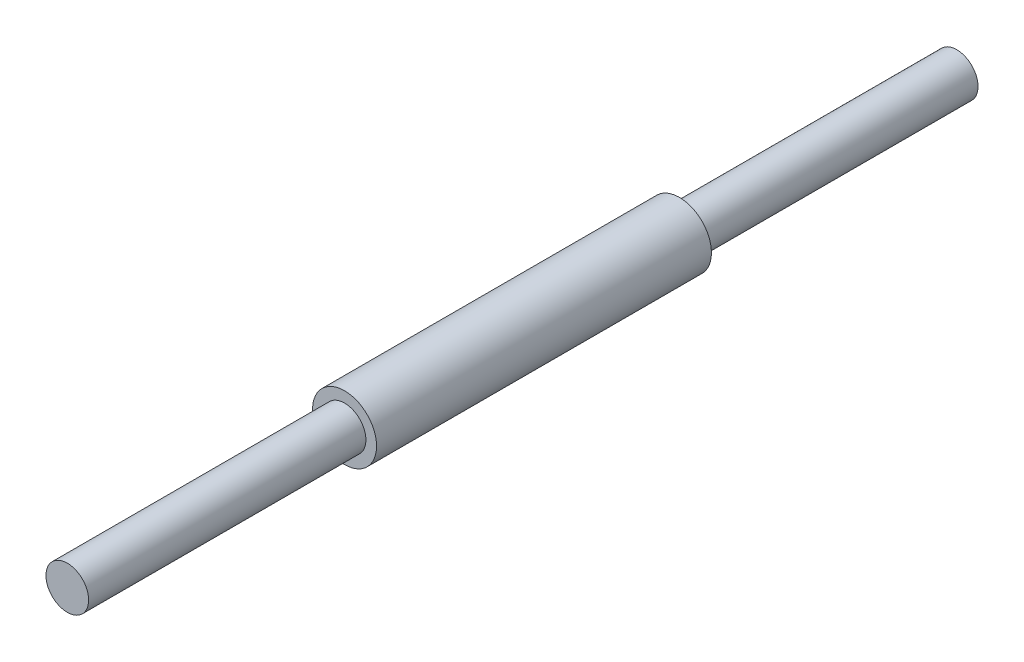
ISO-10303-21;
HEADER;
FILE_DESCRIPTION(('STEP AP214'),'2;1');
FILE_NAME('part.step','',(''),(''),'','','');
FILE_SCHEMA(('AUTOMOTIVE_DESIGN { 1 0 10303 214 1 1 1 1 }'));
ENDSEC;
DATA;
#1=APPLICATION_CONTEXT('core data for automotive mechanical design processes');
#2=APPLICATION_PROTOCOL_DEFINITION('international standard','automotive_design',2000,#1);
#3=PRODUCT_CONTEXT('',#1,'mechanical');
#4=PRODUCT('Part','Part','',(#3));
#5=PRODUCT_RELATED_PRODUCT_CATEGORY('part','',(#4));
#6=PRODUCT_DEFINITION_FORMATION('','',#4);
#7=PRODUCT_DEFINITION_CONTEXT('part definition',#1,'design');
#8=PRODUCT_DEFINITION('design','',#6,#7);
#9=PRODUCT_DEFINITION_SHAPE('','',#8);
#10=(LENGTH_UNIT() NAMED_UNIT(*) SI_UNIT(.MILLI.,.METRE.));
#11=(NAMED_UNIT(*) PLANE_ANGLE_UNIT() SI_UNIT($,.RADIAN.));
#12=(NAMED_UNIT(*) SI_UNIT($,.STERADIAN.) SOLID_ANGLE_UNIT());
#13=UNCERTAINTY_MEASURE_WITH_UNIT(LENGTH_MEASURE(1.E-05),#10,'distance_accuracy_value','');
#14=(GEOMETRIC_REPRESENTATION_CONTEXT(3) GLOBAL_UNCERTAINTY_ASSIGNED_CONTEXT((#13)) GLOBAL_UNIT_ASSIGNED_CONTEXT((#10,
#11,#12)) REPRESENTATION_CONTEXT('',''));
#15=CARTESIAN_POINT('',(0.,0.,0.));
#16=DIRECTION('',(0.,0.,1.));
#17=DIRECTION('',(1.,0.,0.));
#18=AXIS2_PLACEMENT_3D('',#15,#16,#17);
#19=CARTESIAN_POINT('',(0.,0.,39.878));
#20=DIRECTION('',(0.,0.,-1.));
#21=DIRECTION('',(-1.,0.,0.));
#22=AXIS2_PLACEMENT_3D('',#19,#20,#21);
#23=CYLINDRICAL_SURFACE('',#22,3.81);
#24=CARTESIAN_POINT('',(0.,0.,39.878));
#25=DIRECTION('',(0.,0.,1.));
#26=DIRECTION('',(1.,0.,0.));
#27=AXIS2_PLACEMENT_3D('',#24,#25,#26);
#28=CIRCLE('',#27,3.81);
#29=CARTESIAN_POINT('',(3.81,0.,39.878));
#30=VERTEX_POINT('',#29);
#31=EDGE_CURVE('E51',#30,#30,#28,.T.);
#32=ORIENTED_EDGE('',*,*,#31,.F.);
#33=EDGE_LOOP('',(#32));
#34=FACE_BOUND('',#33,.T.);
#35=CARTESIAN_POINT('',(0.,0.,0.));
#36=DIRECTION('',(0.,0.,1.));
#37=DIRECTION('',(1.,0.,0.));
#38=AXIS2_PLACEMENT_3D('',#35,#36,#37);
#39=CIRCLE('',#38,3.81);
#40=CARTESIAN_POINT('',(3.81,0.,0.));
#41=VERTEX_POINT('',#40);
#42=EDGE_CURVE('E40',#41,#41,#39,.T.);
#43=ORIENTED_EDGE('',*,*,#42,.T.);
#44=EDGE_LOOP('',(#43));
#45=FACE_BOUND('',#44,.T.);
#46=ADVANCED_FACE('F37',(#34,#45),#23,.T.);
#47=CARTESIAN_POINT('',(0.,0.,39.878));
#48=DIRECTION('',(0.,0.,1.));
#49=DIRECTION('',(1.,0.,0.));
#50=AXIS2_PLACEMENT_3D('',#47,#48,#49);
#51=PLANE('',#50);
#52=CARTESIAN_POINT('',(0.,0.,39.878));
#53=DIRECTION('',(0.,0.,1.));
#54=DIRECTION('',(1.,0.,0.));
#55=AXIS2_PLACEMENT_3D('',#52,#53,#54);
#56=CIRCLE('',#55,2.54);
#57=CARTESIAN_POINT('',(2.54,0.,39.878));
#58=VERTEX_POINT('',#57);
#59=EDGE_CURVE('E45',#58,#58,#56,.T.);
#60=ORIENTED_EDGE('',*,*,#59,.F.);
#61=EDGE_LOOP('',(#60));
#62=FACE_BOUND('',#61,.T.);
#63=ORIENTED_EDGE('',*,*,#31,.T.);
#64=EDGE_LOOP('',(#63));
#65=FACE_BOUND('',#64,.T.);
#66=ADVANCED_FACE('F71',(#62,#65),#51,.T.);
#67=CARTESIAN_POINT('',(0.,0.,0.));
#68=DIRECTION('',(0.,0.,1.));
#69=DIRECTION('',(1.,0.,0.));
#70=AXIS2_PLACEMENT_3D('',#67,#68,#69);
#71=PLANE('',#70);
#72=CARTESIAN_POINT('',(0.,0.,0.));
#73=DIRECTION('',(0.,0.,-1.));
#74=DIRECTION('',(-1.,0.,0.));
#75=AXIS2_PLACEMENT_3D('',#72,#73,#74);
#76=CIRCLE('',#75,2.54);
#77=CARTESIAN_POINT('',(-2.54,0.,0.));
#78=VERTEX_POINT('',#77);
#79=EDGE_CURVE('E10',#78,#78,#76,.T.);
#80=ORIENTED_EDGE('',*,*,#79,.F.);
#81=EDGE_LOOP('',(#80));
#82=FACE_BOUND('',#81,.T.);
#83=ORIENTED_EDGE('',*,*,#42,.F.);
#84=EDGE_LOOP('',(#83));
#85=FACE_BOUND('',#84,.T.);
#86=ADVANCED_FACE('F68',(#82,#85),#71,.F.);
#87=CARTESIAN_POINT('',(0.,0.,72.898));
#88=DIRECTION('',(0.,0.,-1.));
#89=DIRECTION('',(-1.,0.,0.));
#90=AXIS2_PLACEMENT_3D('',#87,#88,#89);
#91=CYLINDRICAL_SURFACE('',#90,2.54);
#92=CARTESIAN_POINT('',(0.,0.,72.898));
#93=DIRECTION('',(0.,0.,1.));
#94=DIRECTION('',(1.,0.,0.));
#95=AXIS2_PLACEMENT_3D('',#92,#93,#94);
#96=CIRCLE('',#95,2.54);
#97=CARTESIAN_POINT('',(2.54,0.,72.898));
#98=VERTEX_POINT('',#97);
#99=EDGE_CURVE('E56',#98,#98,#96,.T.);
#100=ORIENTED_EDGE('',*,*,#99,.F.);
#101=EDGE_LOOP('',(#100));
#102=FACE_BOUND('',#101,.T.);
#103=ORIENTED_EDGE('',*,*,#59,.T.);
#104=EDGE_LOOP('',(#103));
#105=FACE_BOUND('',#104,.T.);
#106=ADVANCED_FACE('F70',(#102,#105),#91,.T.);
#107=CARTESIAN_POINT('',(0.,0.,72.898));
#108=DIRECTION('',(0.,0.,1.));
#109=DIRECTION('',(1.,0.,0.));
#110=AXIS2_PLACEMENT_3D('',#107,#108,#109);
#111=PLANE('',#110);
#112=ORIENTED_EDGE('',*,*,#99,.T.);
#113=EDGE_LOOP('',(#112));
#114=FACE_BOUND('',#113,.T.);
#115=ADVANCED_FACE('F77',(#114),#111,.T.);
#116=CARTESIAN_POINT('',(0.,0.,-33.02));
#117=DIRECTION('',(0.,0.,1.));
#118=DIRECTION('',(1.,0.,0.));
#119=AXIS2_PLACEMENT_3D('',#116,#117,#118);
#120=CYLINDRICAL_SURFACE('',#119,2.54);
#121=CARTESIAN_POINT('',(0.,0.,-33.02));
#122=DIRECTION('',(0.,0.,-1.));
#123=DIRECTION('',(-1.,0.,0.));
#124=AXIS2_PLACEMENT_3D('',#121,#122,#123);
#125=CIRCLE('',#124,2.54);
#126=CARTESIAN_POINT('',(-2.54,0.,-33.02));
#127=VERTEX_POINT('',#126);
#128=EDGE_CURVE('E55',#127,#127,#125,.T.);
#129=ORIENTED_EDGE('',*,*,#128,.F.);
#130=EDGE_LOOP('',(#129));
#131=FACE_BOUND('',#130,.T.);
#132=ORIENTED_EDGE('',*,*,#79,.T.);
#133=EDGE_LOOP('',(#132));
#134=FACE_BOUND('',#133,.T.);
#135=ADVANCED_FACE('F105',(#131,#134),#120,.T.);
#136=CARTESIAN_POINT('',(0.,0.,-33.02));
#137=DIRECTION('',(0.,0.,-1.));
#138=DIRECTION('',(-1.,0.,0.));
#139=AXIS2_PLACEMENT_3D('',#136,#137,#138);
#140=PLANE('',#139);
#141=ORIENTED_EDGE('',*,*,#128,.T.);
#142=EDGE_LOOP('',(#141));
#143=FACE_BOUND('',#142,.T.);
#144=ADVANCED_FACE('F119',(#143),#140,.T.);
#145=CLOSED_SHELL('',(#46,#66,#86,#106,#115,#135,#144));
#146=MANIFOLD_SOLID_BREP('B2',#145);
#147=ADVANCED_BREP_SHAPE_REPRESENTATION('',(#18,#146),#14);
#148=SHAPE_DEFINITION_REPRESENTATION(#9,#147);
ENDSEC;
END-ISO-10303-21;
